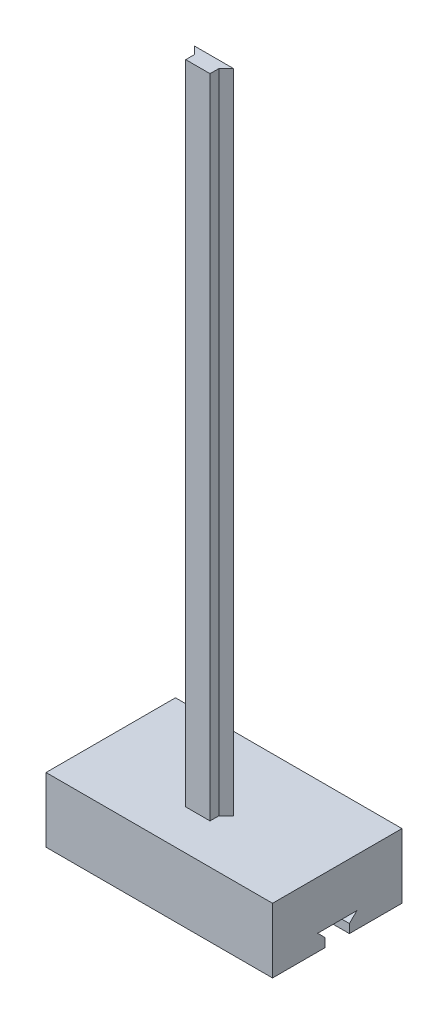
ISO-10303-21;
HEADER;
FILE_DESCRIPTION(('STEP AP214'),'2;1');
FILE_NAME('part.step','',(''),(''),'','','');
FILE_SCHEMA(('AUTOMOTIVE_DESIGN { 1 0 10303 214 1 1 1 1 }'));
ENDSEC;
DATA;
#1=APPLICATION_CONTEXT('core data for automotive mechanical design processes');
#2=APPLICATION_PROTOCOL_DEFINITION('international standard','automotive_design',2000,#1);
#3=PRODUCT_CONTEXT('',#1,'mechanical');
#4=PRODUCT('Part','Part','',(#3));
#5=PRODUCT_RELATED_PRODUCT_CATEGORY('part','',(#4));
#6=PRODUCT_DEFINITION_FORMATION('','',#4);
#7=PRODUCT_DEFINITION_CONTEXT('part definition',#1,'design');
#8=PRODUCT_DEFINITION('design','',#6,#7);
#9=PRODUCT_DEFINITION_SHAPE('','',#8);
#10=(LENGTH_UNIT() NAMED_UNIT(*) SI_UNIT(.MILLI.,.METRE.));
#11=(NAMED_UNIT(*) PLANE_ANGLE_UNIT() SI_UNIT($,.RADIAN.));
#12=(NAMED_UNIT(*) SI_UNIT($,.STERADIAN.) SOLID_ANGLE_UNIT());
#13=UNCERTAINTY_MEASURE_WITH_UNIT(LENGTH_MEASURE(1.E-05),#10,'distance_accuracy_value','');
#14=(GEOMETRIC_REPRESENTATION_CONTEXT(3) GLOBAL_UNCERTAINTY_ASSIGNED_CONTEXT((#13)) GLOBAL_UNIT_ASSIGNED_CONTEXT((#10,
#11,#12)) REPRESENTATION_CONTEXT('',''));
#15=CARTESIAN_POINT('',(0.,0.,0.));
#16=DIRECTION('',(0.,0.,1.));
#17=DIRECTION('',(1.,0.,0.));
#18=AXIS2_PLACEMENT_3D('',#15,#16,#17);
#19=CARTESIAN_POINT('',(0.,50.8,0.));
#20=DIRECTION('',(0.,-1.,0.));
#21=DIRECTION('',(0.,0.,-1.));
#22=AXIS2_PLACEMENT_3D('',#19,#20,#21);
#23=PLANE('',#22);
#24=DIRECTION('',(0.,0.,1.));
#25=VECTOR('',#24,1.);
#26=CARTESIAN_POINT('',(0.,50.8,0.));
#27=LINE('',#26,#25);
#28=CARTESIAN_POINT('',(0.,50.8,-101.6));
#29=VERTEX_POINT('',#28);
#30=CARTESIAN_POINT('',(0.,50.8,0.));
#31=VERTEX_POINT('',#30);
#32=EDGE_CURVE('E215',#29,#31,#27,.T.);
#33=ORIENTED_EDGE('',*,*,#32,.T.);
#34=DIRECTION('',(1.,0.,0.));
#35=VECTOR('',#34,1.);
#36=CARTESIAN_POINT('',(0.,50.8,0.));
#37=LINE('',#36,#35);
#38=CARTESIAN_POINT('',(177.8,50.8,0.));
#39=VERTEX_POINT('',#38);
#40=EDGE_CURVE('E218',#31,#39,#37,.T.);
#41=ORIENTED_EDGE('',*,*,#40,.T.);
#42=DIRECTION('',(0.,0.,-1.));
#43=VECTOR('',#42,1.);
#44=CARTESIAN_POINT('',(177.8,50.8,0.));
#45=LINE('',#44,#43);
#46=CARTESIAN_POINT('',(177.8,50.8,-101.6));
#47=VERTEX_POINT('',#46);
#48=EDGE_CURVE('E221',#39,#47,#45,.T.);
#49=ORIENTED_EDGE('',*,*,#48,.T.);
#50=DIRECTION('',(-1.,0.,0.));
#51=VECTOR('',#50,1.);
#52=CARTESIAN_POINT('',(0.,50.8,-101.6));
#53=LINE('',#52,#51);
#54=EDGE_CURVE('E223',#47,#29,#53,.T.);
#55=ORIENTED_EDGE('',*,*,#54,.T.);
#56=EDGE_LOOP('',(#33,#41,#49,#55));
#57=FACE_BOUND('',#56,.T.);
#58=DIRECTION('',(1.,0.,0.));
#59=VECTOR('',#58,1.);
#60=CARTESIAN_POINT('',(97.2926260621035,50.8,-31.4296567142033));
#61=LINE('',#60,#59);
#62=CARTESIAN_POINT('',(78.2426260621035,50.8,-31.4296567142033));
#63=VERTEX_POINT('',#62);
#64=CARTESIAN_POINT('',(97.2926260621035,50.8,-31.4296567142033));
#65=VERTEX_POINT('',#64);
#66=EDGE_CURVE('E166',#63,#65,#61,.T.);
#67=ORIENTED_EDGE('',*,*,#66,.F.);
#68=DIRECTION('',(0.,0.,1.));
#69=VECTOR('',#68,1.);
#70=CARTESIAN_POINT('',(78.2426260621035,50.8,-31.4296567142033));
#71=LINE('',#70,#69);
#72=CARTESIAN_POINT('',(78.2426260621035,50.8,-38.2876567142034));
#73=VERTEX_POINT('',#72);
#74=EDGE_CURVE('E163',#73,#63,#71,.T.);
#75=ORIENTED_EDGE('',*,*,#74,.F.);
#76=DIRECTION('',(0.707106781186548,0.,0.707106781186547));
#77=VECTOR('',#76,1.);
#78=CARTESIAN_POINT('',(78.2426260621035,50.8,-38.2876567142034));
#79=LINE('',#78,#77);
#80=CARTESIAN_POINT('',(72.4006260621037,50.8,-44.1296567142033));
#81=VERTEX_POINT('',#80);
#82=EDGE_CURVE('E449',#81,#73,#79,.T.);
#83=ORIENTED_EDGE('',*,*,#82,.F.);
#84=DIRECTION('',(-1.,0.,0.));
#85=VECTOR('',#84,1.);
#86=CARTESIAN_POINT('',(72.4006260621037,50.8,-44.1296567142033));
#87=LINE('',#86,#85);
#88=CARTESIAN_POINT('',(103.134626062104,50.8,-44.1296567142033));
#89=VERTEX_POINT('',#88);
#90=EDGE_CURVE('E464',#89,#81,#87,.T.);
#91=ORIENTED_EDGE('',*,*,#90,.F.);
#92=DIRECTION('',(0.707106781186547,0.,-0.707106781186547));
#93=VECTOR('',#92,1.);
#94=CARTESIAN_POINT('',(103.134626062104,50.8,-44.1296567142033));
#95=LINE('',#94,#93);
#96=CARTESIAN_POINT('',(97.2926260621035,50.8,-38.2876567142032));
#97=VERTEX_POINT('',#96);
#98=EDGE_CURVE('E53',#97,#89,#95,.T.);
#99=ORIENTED_EDGE('',*,*,#98,.F.);
#100=DIRECTION('',(0.,0.,-1.));
#101=VECTOR('',#100,1.);
#102=CARTESIAN_POINT('',(97.2926260621035,50.8,-38.2876567142032));
#103=LINE('',#102,#101);
#104=EDGE_CURVE('E48',#65,#97,#103,.T.);
#105=ORIENTED_EDGE('',*,*,#104,.F.);
#106=EDGE_LOOP('',(#67,#75,#83,#91,#99,#105));
#107=FACE_BOUND('',#106,.T.);
#108=ADVANCED_FACE('F33',(#57,#107),#23,.F.);
#109=CARTESIAN_POINT('',(0.,0.,0.));
#110=DIRECTION('',(0.,-1.,0.));
#111=DIRECTION('',(0.,0.,-1.));
#112=AXIS2_PLACEMENT_3D('',#109,#110,#111);
#113=PLANE('',#112);
#114=DIRECTION('',(1.,0.,0.));
#115=VECTOR('',#114,1.);
#116=CARTESIAN_POINT('',(0.,0.,-41.275));
#117=LINE('',#116,#115);
#118=CARTESIAN_POINT('',(0.,0.,-41.275));
#119=VERTEX_POINT('',#118);
#120=CARTESIAN_POINT('',(177.8,0.,-41.275));
#121=VERTEX_POINT('',#120);
#122=EDGE_CURVE('E202',#119,#121,#117,.T.);
#123=ORIENTED_EDGE('',*,*,#122,.T.);
#124=DIRECTION('',(0.,0.,-1.));
#125=VECTOR('',#124,1.);
#126=CARTESIAN_POINT('',(177.8,0.,0.));
#127=LINE('',#126,#125);
#128=CARTESIAN_POINT('',(177.8,0.,0.));
#129=VERTEX_POINT('',#128);
#130=EDGE_CURVE('E232',#129,#121,#127,.T.);
#131=ORIENTED_EDGE('',*,*,#130,.F.);
#132=DIRECTION('',(1.,0.,0.));
#133=VECTOR('',#132,1.);
#134=CARTESIAN_POINT('',(0.,0.,0.));
#135=LINE('',#134,#133);
#136=CARTESIAN_POINT('',(0.,0.,0.));
#137=VERTEX_POINT('',#136);
#138=EDGE_CURVE('E229',#137,#129,#135,.T.);
#139=ORIENTED_EDGE('',*,*,#138,.F.);
#140=DIRECTION('',(0.,0.,1.));
#141=VECTOR('',#140,1.);
#142=CARTESIAN_POINT('',(0.,0.,0.));
#143=LINE('',#142,#141);
#144=EDGE_CURVE('E205',#119,#137,#143,.T.);
#145=ORIENTED_EDGE('',*,*,#144,.F.);
#146=EDGE_LOOP('',(#123,#131,#139,#145));
#147=FACE_BOUND('',#146,.T.);
#148=ADVANCED_FACE('F251',(#147),#113,.T.);
#149=CARTESIAN_POINT('',(0.,50.8,0.));
#150=DIRECTION('',(1.,0.,0.));
#151=DIRECTION('',(0.,0.,-1.));
#152=AXIS2_PLACEMENT_3D('',#149,#150,#151);
#153=PLANE('',#152);
#154=DIRECTION('',(0.,-0.707106781186544,-0.707106781186551));
#155=VECTOR('',#154,1.);
#156=CARTESIAN_POINT('',(0.,6.85800000000012,-41.275));
#157=LINE('',#156,#155);
#158=CARTESIAN_POINT('',(0.,12.7,-35.4330000000001));
#159=VERTEX_POINT('',#158);
#160=CARTESIAN_POINT('',(0.,6.85800000000012,-41.275));
#161=VERTEX_POINT('',#160);
#162=EDGE_CURVE('E186',#159,#161,#157,.T.);
#163=ORIENTED_EDGE('',*,*,#162,.T.);
#164=DIRECTION('',(0.,-1.,0.));
#165=VECTOR('',#164,1.);
#166=CARTESIAN_POINT('',(0.,0.,-41.275));
#167=LINE('',#166,#165);
#168=EDGE_CURVE('E189',#161,#119,#167,.T.);
#169=ORIENTED_EDGE('',*,*,#168,.T.);
#170=ORIENTED_EDGE('',*,*,#144,.T.);
#171=DIRECTION('',(0.,-1.,0.));
#172=VECTOR('',#171,1.);
#173=CARTESIAN_POINT('',(0.,50.8,0.));
#174=LINE('',#173,#172);
#175=EDGE_CURVE('E11',#31,#137,#174,.T.);
#176=ORIENTED_EDGE('',*,*,#175,.F.);
#177=ORIENTED_EDGE('',*,*,#32,.F.);
#178=DIRECTION('',(0.,-1.,0.));
#179=VECTOR('',#178,1.);
#180=CARTESIAN_POINT('',(0.,50.8,-101.6));
#181=LINE('',#180,#179);
#182=CARTESIAN_POINT('',(0.,0.,-101.6));
#183=VERTEX_POINT('',#182);
#184=EDGE_CURVE('E225',#29,#183,#181,.T.);
#185=ORIENTED_EDGE('',*,*,#184,.T.);
#186=CARTESIAN_POINT('',(0.,0.,-60.325));
#187=VERTEX_POINT('',#186);
#188=EDGE_CURVE('E226',#183,#187,#143,.T.);
#189=ORIENTED_EDGE('',*,*,#188,.T.);
#190=DIRECTION('',(0.,1.,0.));
#191=VECTOR('',#190,1.);
#192=CARTESIAN_POINT('',(0.,6.858,-60.325));
#193=LINE('',#192,#191);
#194=CARTESIAN_POINT('',(0.,6.858,-60.325));
#195=VERTEX_POINT('',#194);
#196=EDGE_CURVE('E176',#187,#195,#193,.T.);
#197=ORIENTED_EDGE('',*,*,#196,.T.);
#198=DIRECTION('',(0.,0.707106781186544,-0.707106781186551));
#199=VECTOR('',#198,1.);
#200=CARTESIAN_POINT('',(0.,12.7,-66.1670000000001));
#201=LINE('',#200,#199);
#202=CARTESIAN_POINT('',(0.,12.7,-66.1670000000001));
#203=VERTEX_POINT('',#202);
#204=EDGE_CURVE('E179',#195,#203,#201,.T.);
#205=ORIENTED_EDGE('',*,*,#204,.T.);
#206=DIRECTION('',(0.,0.,1.));
#207=VECTOR('',#206,1.);
#208=CARTESIAN_POINT('',(0.,12.7,-35.4330000000001));
#209=LINE('',#208,#207);
#210=EDGE_CURVE('E183',#203,#159,#209,.T.);
#211=ORIENTED_EDGE('',*,*,#210,.T.);
#212=EDGE_LOOP('',(#163,#169,#170,#176,#177,#185,#189,#197,#205,#211));
#213=FACE_BOUND('',#212,.T.);
#214=ADVANCED_FACE('F35',(#213),#153,.F.);
#215=CARTESIAN_POINT('',(0.,50.8,0.));
#216=DIRECTION('',(0.,0.,-1.));
#217=DIRECTION('',(-1.,0.,0.));
#218=AXIS2_PLACEMENT_3D('',#215,#216,#217);
#219=PLANE('',#218);
#220=ORIENTED_EDGE('',*,*,#138,.T.);
#221=DIRECTION('',(0.,-1.,0.));
#222=VECTOR('',#221,1.);
#223=CARTESIAN_POINT('',(177.8,50.8,0.));
#224=LINE('',#223,#222);
#225=EDGE_CURVE('E41',#39,#129,#224,.T.);
#226=ORIENTED_EDGE('',*,*,#225,.F.);
#227=ORIENTED_EDGE('',*,*,#40,.F.);
#228=ORIENTED_EDGE('',*,*,#175,.T.);
#229=EDGE_LOOP('',(#220,#226,#227,#228));
#230=FACE_BOUND('',#229,.T.);
#231=ADVANCED_FACE('F285',(#230),#219,.F.);
#232=CARTESIAN_POINT('',(177.8,50.8,0.));
#233=DIRECTION('',(-1.,0.,0.));
#234=DIRECTION('',(0.,0.,1.));
#235=AXIS2_PLACEMENT_3D('',#232,#233,#234);
#236=PLANE('',#235);
#237=ORIENTED_EDGE('',*,*,#130,.T.);
#238=DIRECTION('',(0.,-1.,0.));
#239=VECTOR('',#238,1.);
#240=CARTESIAN_POINT('',(177.8,0.,-41.275));
#241=LINE('',#240,#239);
#242=CARTESIAN_POINT('',(177.8,6.85800000000012,-41.275));
#243=VERTEX_POINT('',#242);
#244=EDGE_CURVE('E180',#243,#121,#241,.T.);
#245=ORIENTED_EDGE('',*,*,#244,.F.);
#246=DIRECTION('',(0.,-0.707106781186544,-0.707106781186551));
#247=VECTOR('',#246,1.);
#248=CARTESIAN_POINT('',(177.8,6.85800000000012,-41.275));
#249=LINE('',#248,#247);
#250=CARTESIAN_POINT('',(177.8,12.7,-35.4330000000001));
#251=VERTEX_POINT('',#250);
#252=EDGE_CURVE('E198',#251,#243,#249,.T.);
#253=ORIENTED_EDGE('',*,*,#252,.F.);
#254=DIRECTION('',(0.,0.,1.));
#255=VECTOR('',#254,1.);
#256=CARTESIAN_POINT('',(177.8,12.7,-35.4330000000001));
#257=LINE('',#256,#255);
#258=CARTESIAN_POINT('',(177.8,12.7,-66.1670000000001));
#259=VERTEX_POINT('',#258);
#260=EDGE_CURVE('E195',#259,#251,#257,.T.);
#261=ORIENTED_EDGE('',*,*,#260,.F.);
#262=DIRECTION('',(0.,0.707106781186544,-0.707106781186551));
#263=VECTOR('',#262,1.);
#264=CARTESIAN_POINT('',(177.8,12.7,-66.1670000000001));
#265=LINE('',#264,#263);
#266=CARTESIAN_POINT('',(177.8,6.858,-60.325));
#267=VERTEX_POINT('',#266);
#268=EDGE_CURVE('E170',#267,#259,#265,.T.);
#269=ORIENTED_EDGE('',*,*,#268,.F.);
#270=DIRECTION('',(0.,1.,0.));
#271=VECTOR('',#270,1.);
#272=CARTESIAN_POINT('',(177.8,6.858,-60.325));
#273=LINE('',#272,#271);
#274=CARTESIAN_POINT('',(177.8,0.,-60.325));
#275=VERTEX_POINT('',#274);
#276=EDGE_CURVE('E167',#275,#267,#273,.T.);
#277=ORIENTED_EDGE('',*,*,#276,.F.);
#278=CARTESIAN_POINT('',(177.8,0.,-101.6));
#279=VERTEX_POINT('',#278);
#280=EDGE_CURVE('E231',#275,#279,#127,.T.);
#281=ORIENTED_EDGE('',*,*,#280,.T.);
#282=DIRECTION('',(0.,-1.,0.));
#283=VECTOR('',#282,1.);
#284=CARTESIAN_POINT('',(177.8,50.8,-101.6));
#285=LINE('',#284,#283);
#286=EDGE_CURVE('E238',#47,#279,#285,.T.);
#287=ORIENTED_EDGE('',*,*,#286,.F.);
#288=ORIENTED_EDGE('',*,*,#48,.F.);
#289=ORIENTED_EDGE('',*,*,#225,.T.);
#290=EDGE_LOOP('',(#237,#245,#253,#261,#269,#277,#281,#287,#288,#289));
#291=FACE_BOUND('',#290,.T.);
#292=ADVANCED_FACE('F245',(#291),#236,.F.);
#293=CARTESIAN_POINT('',(0.,50.8,-101.6));
#294=DIRECTION('',(0.,0.,1.));
#295=DIRECTION('',(1.,0.,0.));
#296=AXIS2_PLACEMENT_3D('',#293,#294,#295);
#297=PLANE('',#296);
#298=DIRECTION('',(-1.,0.,0.));
#299=VECTOR('',#298,1.);
#300=CARTESIAN_POINT('',(0.,0.,-101.6));
#301=LINE('',#300,#299);
#302=EDGE_CURVE('E219',#279,#183,#301,.T.);
#303=ORIENTED_EDGE('',*,*,#302,.T.);
#304=ORIENTED_EDGE('',*,*,#184,.F.);
#305=ORIENTED_EDGE('',*,*,#54,.F.);
#306=ORIENTED_EDGE('',*,*,#286,.T.);
#307=EDGE_LOOP('',(#303,#304,#305,#306));
#308=FACE_BOUND('',#307,.T.);
#309=ADVANCED_FACE('F281',(#308),#297,.F.);
#310=DIRECTION('',(1.,0.,0.));
#311=VECTOR('',#310,1.);
#312=CARTESIAN_POINT('',(0.,0.,-60.325));
#313=LINE('',#312,#311);
#314=EDGE_CURVE('E191',#187,#275,#313,.T.);
#315=ORIENTED_EDGE('',*,*,#314,.F.);
#316=ORIENTED_EDGE('',*,*,#188,.F.);
#317=ORIENTED_EDGE('',*,*,#302,.F.);
#318=ORIENTED_EDGE('',*,*,#280,.F.);
#319=EDGE_LOOP('',(#315,#316,#317,#318));
#320=FACE_BOUND('',#319,.T.);
#321=ADVANCED_FACE('F277',(#320),#113,.T.);
#322=CARTESIAN_POINT('',(0.,0.,-41.275));
#323=DIRECTION('',(0.,0.,1.));
#324=DIRECTION('',(1.,0.,0.));
#325=AXIS2_PLACEMENT_3D('',#322,#323,#324);
#326=PLANE('',#325);
#327=ORIENTED_EDGE('',*,*,#244,.T.);
#328=ORIENTED_EDGE('',*,*,#122,.F.);
#329=ORIENTED_EDGE('',*,*,#168,.F.);
#330=DIRECTION('',(1.,0.,0.));
#331=VECTOR('',#330,1.);
#332=CARTESIAN_POINT('',(0.,6.85800000000012,-41.275));
#333=LINE('',#332,#331);
#334=EDGE_CURVE('E206',#161,#243,#333,.T.);
#335=ORIENTED_EDGE('',*,*,#334,.T.);
#336=EDGE_LOOP('',(#327,#328,#329,#335));
#337=FACE_BOUND('',#336,.T.);
#338=ADVANCED_FACE('F255',(#337),#326,.F.);
#339=CARTESIAN_POINT('',(0.,6.85800000000012,-41.275));
#340=DIRECTION('',(0.,-0.707106781186551,0.707106781186544));
#341=DIRECTION('',(0.,-0.707106781186544,-0.707106781186551));
#342=AXIS2_PLACEMENT_3D('',#339,#340,#341);
#343=PLANE('',#342);
#344=ORIENTED_EDGE('',*,*,#252,.T.);
#345=ORIENTED_EDGE('',*,*,#334,.F.);
#346=ORIENTED_EDGE('',*,*,#162,.F.);
#347=DIRECTION('',(1.,0.,0.));
#348=VECTOR('',#347,1.);
#349=CARTESIAN_POINT('',(0.,12.7,-35.4330000000001));
#350=LINE('',#349,#348);
#351=EDGE_CURVE('E208',#159,#251,#350,.T.);
#352=ORIENTED_EDGE('',*,*,#351,.T.);
#353=EDGE_LOOP('',(#344,#345,#346,#352));
#354=FACE_BOUND('',#353,.T.);
#355=ADVANCED_FACE('F261',(#354),#343,.F.);
#356=CARTESIAN_POINT('',(0.,12.7,-35.4330000000001));
#357=DIRECTION('',(0.,1.,0.));
#358=DIRECTION('',(0.,0.,1.));
#359=AXIS2_PLACEMENT_3D('',#356,#357,#358);
#360=PLANE('',#359);
#361=ORIENTED_EDGE('',*,*,#260,.T.);
#362=ORIENTED_EDGE('',*,*,#351,.F.);
#363=ORIENTED_EDGE('',*,*,#210,.F.);
#364=DIRECTION('',(1.,0.,0.));
#365=VECTOR('',#364,1.);
#366=CARTESIAN_POINT('',(0.,12.7,-66.1670000000001));
#367=LINE('',#366,#365);
#368=EDGE_CURVE('E210',#203,#259,#367,.T.);
#369=ORIENTED_EDGE('',*,*,#368,.T.);
#370=EDGE_LOOP('',(#361,#362,#363,#369));
#371=FACE_BOUND('',#370,.T.);
#372=ADVANCED_FACE('F267',(#371),#360,.F.);
#373=CARTESIAN_POINT('',(0.,12.7,-66.1670000000001));
#374=DIRECTION('',(0.,-0.707106781186551,-0.707106781186544));
#375=DIRECTION('',(0.,0.707106781186544,-0.707106781186551));
#376=AXIS2_PLACEMENT_3D('',#373,#374,#375);
#377=PLANE('',#376);
#378=ORIENTED_EDGE('',*,*,#268,.T.);
#379=ORIENTED_EDGE('',*,*,#368,.F.);
#380=ORIENTED_EDGE('',*,*,#204,.F.);
#381=DIRECTION('',(1.,0.,0.));
#382=VECTOR('',#381,1.);
#383=CARTESIAN_POINT('',(0.,6.858,-60.325));
#384=LINE('',#383,#382);
#385=EDGE_CURVE('E212',#195,#267,#384,.T.);
#386=ORIENTED_EDGE('',*,*,#385,.T.);
#387=EDGE_LOOP('',(#378,#379,#380,#386));
#388=FACE_BOUND('',#387,.T.);
#389=ADVANCED_FACE('F270',(#388),#377,.F.);
#390=CARTESIAN_POINT('',(0.,6.858,-60.325));
#391=DIRECTION('',(0.,0.,-1.));
#392=DIRECTION('',(-1.,0.,0.));
#393=AXIS2_PLACEMENT_3D('',#390,#391,#392);
#394=PLANE('',#393);
#395=ORIENTED_EDGE('',*,*,#276,.T.);
#396=ORIENTED_EDGE('',*,*,#385,.F.);
#397=ORIENTED_EDGE('',*,*,#196,.F.);
#398=ORIENTED_EDGE('',*,*,#314,.T.);
#399=EDGE_LOOP('',(#395,#396,#397,#398));
#400=FACE_BOUND('',#399,.T.);
#401=ADVANCED_FACE('F272',(#400),#394,.F.);
#402=CARTESIAN_POINT('',(97.2926260621035,558.8,-31.4296567142033));
#403=DIRECTION('',(0.,0.,-1.));
#404=DIRECTION('',(-1.,0.,0.));
#405=AXIS2_PLACEMENT_3D('',#402,#403,#404);
#406=PLANE('',#405);
#407=ORIENTED_EDGE('',*,*,#66,.T.);
#408=DIRECTION('',(0.,-1.,0.));
#409=VECTOR('',#408,1.);
#410=CARTESIAN_POINT('',(97.2926260621035,558.8,-31.4296567142033));
#411=LINE('',#410,#409);
#412=CARTESIAN_POINT('',(97.2926260621035,558.8,-31.4296567142033));
#413=VERTEX_POINT('',#412);
#414=EDGE_CURVE('E147',#413,#65,#411,.T.);
#415=ORIENTED_EDGE('',*,*,#414,.F.);
#416=DIRECTION('',(1.,0.,0.));
#417=VECTOR('',#416,1.);
#418=CARTESIAN_POINT('',(97.2926260621035,558.8,-31.4296567142033));
#419=LINE('',#418,#417);
#420=CARTESIAN_POINT('',(78.2426260621035,558.8,-31.4296567142033));
#421=VERTEX_POINT('',#420);
#422=EDGE_CURVE('E154',#421,#413,#419,.T.);
#423=ORIENTED_EDGE('',*,*,#422,.F.);
#424=DIRECTION('',(0.,-1.,0.));
#425=VECTOR('',#424,1.);
#426=CARTESIAN_POINT('',(78.2426260621035,558.8,-31.4296567142033));
#427=LINE('',#426,#425);
#428=EDGE_CURVE('E445',#421,#63,#427,.T.);
#429=ORIENTED_EDGE('',*,*,#428,.T.);
#430=EDGE_LOOP('',(#407,#415,#423,#429));
#431=FACE_BOUND('',#430,.T.);
#432=ADVANCED_FACE('F165',(#431),#406,.F.);
#433=CARTESIAN_POINT('',(97.2926260621035,558.8,-38.2876567142032));
#434=DIRECTION('',(-1.,0.,0.));
#435=DIRECTION('',(0.,0.,1.));
#436=AXIS2_PLACEMENT_3D('',#433,#434,#435);
#437=PLANE('',#436);
#438=ORIENTED_EDGE('',*,*,#104,.T.);
#439=DIRECTION('',(0.,-1.,0.));
#440=VECTOR('',#439,1.);
#441=CARTESIAN_POINT('',(97.2926260621035,558.8,-38.2876567142032));
#442=LINE('',#441,#440);
#443=CARTESIAN_POINT('',(97.2926260621035,558.8,-38.2876567142032));
#444=VERTEX_POINT('',#443);
#445=EDGE_CURVE('E150',#444,#97,#442,.T.);
#446=ORIENTED_EDGE('',*,*,#445,.F.);
#447=DIRECTION('',(0.,0.,-1.));
#448=VECTOR('',#447,1.);
#449=CARTESIAN_POINT('',(97.2926260621035,558.8,-38.2876567142032));
#450=LINE('',#449,#448);
#451=EDGE_CURVE('E143',#413,#444,#450,.T.);
#452=ORIENTED_EDGE('',*,*,#451,.F.);
#453=ORIENTED_EDGE('',*,*,#414,.T.);
#454=EDGE_LOOP('',(#438,#446,#452,#453));
#455=FACE_BOUND('',#454,.T.);
#456=ADVANCED_FACE('F145',(#455),#437,.F.);
#457=CARTESIAN_POINT('',(103.134626062104,558.8,-44.1296567142033));
#458=DIRECTION('',(-0.707106781186548,0.,-0.707106781186548));
#459=DIRECTION('',(-0.707106781186548,0.,0.707106781186548));
#460=AXIS2_PLACEMENT_3D('',#457,#458,#459);
#461=PLANE('',#460);
#462=ORIENTED_EDGE('',*,*,#98,.T.);
#463=DIRECTION('',(0.,-1.,0.));
#464=VECTOR('',#463,1.);
#465=CARTESIAN_POINT('',(103.134626062104,558.8,-44.1296567142033));
#466=LINE('',#465,#464);
#467=CARTESIAN_POINT('',(103.134626062104,558.8,-44.1296567142033));
#468=VERTEX_POINT('',#467);
#469=EDGE_CURVE('E172',#468,#89,#466,.T.);
#470=ORIENTED_EDGE('',*,*,#469,.F.);
#471=DIRECTION('',(0.707106781186547,0.,-0.707106781186547));
#472=VECTOR('',#471,1.);
#473=CARTESIAN_POINT('',(103.134626062104,558.8,-44.1296567142033));
#474=LINE('',#473,#472);
#475=EDGE_CURVE('E153',#444,#468,#474,.T.);
#476=ORIENTED_EDGE('',*,*,#475,.F.);
#477=ORIENTED_EDGE('',*,*,#445,.T.);
#478=EDGE_LOOP('',(#462,#470,#476,#477));
#479=FACE_BOUND('',#478,.T.);
#480=ADVANCED_FACE('F352',(#479),#461,.F.);
#481=CARTESIAN_POINT('',(72.4006260621037,558.8,-44.1296567142033));
#482=DIRECTION('',(0.,0.,1.));
#483=DIRECTION('',(1.,0.,0.));
#484=AXIS2_PLACEMENT_3D('',#481,#482,#483);
#485=PLANE('',#484);
#486=ORIENTED_EDGE('',*,*,#90,.T.);
#487=DIRECTION('',(0.,-1.,0.));
#488=VECTOR('',#487,1.);
#489=CARTESIAN_POINT('',(72.4006260621037,558.8,-44.1296567142033));
#490=LINE('',#489,#488);
#491=CARTESIAN_POINT('',(72.4006260621037,558.8,-44.1296567142033));
#492=VERTEX_POINT('',#491);
#493=EDGE_CURVE('E452',#492,#81,#490,.T.);
#494=ORIENTED_EDGE('',*,*,#493,.F.);
#495=DIRECTION('',(-1.,0.,0.));
#496=VECTOR('',#495,1.);
#497=CARTESIAN_POINT('',(72.4006260621037,558.8,-44.1296567142033));
#498=LINE('',#497,#496);
#499=EDGE_CURVE('E465',#468,#492,#498,.T.);
#500=ORIENTED_EDGE('',*,*,#499,.F.);
#501=ORIENTED_EDGE('',*,*,#469,.T.);
#502=EDGE_LOOP('',(#486,#494,#500,#501));
#503=FACE_BOUND('',#502,.T.);
#504=ADVANCED_FACE('F359',(#503),#485,.F.);
#505=CARTESIAN_POINT('',(78.2426260621035,558.8,-38.2876567142034));
#506=DIRECTION('',(0.707106781186547,0.,-0.707106781186548));
#507=DIRECTION('',(-0.707106781186548,0.,-0.707106781186547));
#508=AXIS2_PLACEMENT_3D('',#505,#506,#507);
#509=PLANE('',#508);
#510=ORIENTED_EDGE('',*,*,#82,.T.);
#511=DIRECTION('',(0.,-1.,0.));
#512=VECTOR('',#511,1.);
#513=CARTESIAN_POINT('',(78.2426260621035,558.8,-38.2876567142034));
#514=LINE('',#513,#512);
#515=CARTESIAN_POINT('',(78.2426260621035,558.8,-38.2876567142034));
#516=VERTEX_POINT('',#515);
#517=EDGE_CURVE('E447',#516,#73,#514,.T.);
#518=ORIENTED_EDGE('',*,*,#517,.F.);
#519=DIRECTION('',(0.707106781186548,0.,0.707106781186547));
#520=VECTOR('',#519,1.);
#521=CARTESIAN_POINT('',(78.2426260621035,558.8,-38.2876567142034));
#522=LINE('',#521,#520);
#523=EDGE_CURVE('E454',#492,#516,#522,.T.);
#524=ORIENTED_EDGE('',*,*,#523,.F.);
#525=ORIENTED_EDGE('',*,*,#493,.T.);
#526=EDGE_LOOP('',(#510,#518,#524,#525));
#527=FACE_BOUND('',#526,.T.);
#528=ADVANCED_FACE('F367',(#527),#509,.F.);
#529=CARTESIAN_POINT('',(78.2426260621035,558.8,-31.4296567142033));
#530=DIRECTION('',(1.,0.,0.));
#531=DIRECTION('',(0.,0.,-1.));
#532=AXIS2_PLACEMENT_3D('',#529,#530,#531);
#533=PLANE('',#532);
#534=ORIENTED_EDGE('',*,*,#74,.T.);
#535=ORIENTED_EDGE('',*,*,#428,.F.);
#536=DIRECTION('',(0.,0.,1.));
#537=VECTOR('',#536,1.);
#538=CARTESIAN_POINT('',(78.2426260621035,558.8,-31.4296567142033));
#539=LINE('',#538,#537);
#540=EDGE_CURVE('E159',#516,#421,#539,.T.);
#541=ORIENTED_EDGE('',*,*,#540,.F.);
#542=ORIENTED_EDGE('',*,*,#517,.T.);
#543=EDGE_LOOP('',(#534,#535,#541,#542));
#544=FACE_BOUND('',#543,.T.);
#545=ADVANCED_FACE('F375',(#544),#533,.F.);
#546=CARTESIAN_POINT('',(0.,558.8,0.));
#547=DIRECTION('',(0.,-1.,0.));
#548=DIRECTION('',(0.,0.,-1.));
#549=AXIS2_PLACEMENT_3D('',#546,#547,#548);
#550=PLANE('',#549);
#551=ORIENTED_EDGE('',*,*,#422,.T.);
#552=ORIENTED_EDGE('',*,*,#451,.T.);
#553=ORIENTED_EDGE('',*,*,#475,.T.);
#554=ORIENTED_EDGE('',*,*,#499,.T.);
#555=ORIENTED_EDGE('',*,*,#523,.T.);
#556=ORIENTED_EDGE('',*,*,#540,.T.);
#557=EDGE_LOOP('',(#551,#552,#553,#554,#555,#556));
#558=FACE_BOUND('',#557,.T.);
#559=ADVANCED_FACE('F157',(#558),#550,.F.);
#560=CLOSED_SHELL('',(#108,#148,#214,#231,#292,#309,#321,#338,#355,#372,#389,#401,#432,#456,
#480,#504,#528,#545,#559));
#561=MANIFOLD_SOLID_BREP('B2',#560);
#562=ADVANCED_BREP_SHAPE_REPRESENTATION('',(#18,#561),#14);
#563=SHAPE_DEFINITION_REPRESENTATION(#9,#562);
ENDSEC;
END-ISO-10303-21;
